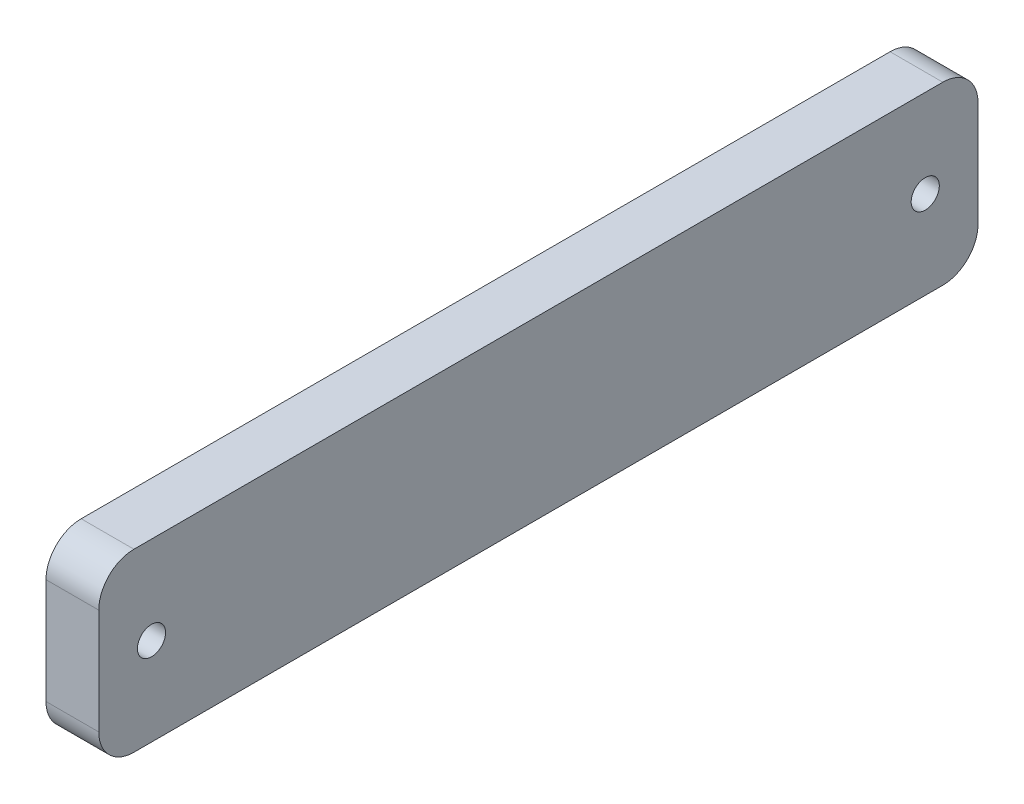
ISO-10303-21;
HEADER;
FILE_DESCRIPTION(('STEP AP214'),'2;1');
FILE_NAME('part.step','',(''),(''),'','','');
FILE_SCHEMA(('AUTOMOTIVE_DESIGN { 1 0 10303 214 1 1 1 1 }'));
ENDSEC;
DATA;
#1=APPLICATION_CONTEXT('core data for automotive mechanical design processes');
#2=APPLICATION_PROTOCOL_DEFINITION('international standard','automotive_design',2000,#1);
#3=PRODUCT_CONTEXT('',#1,'mechanical');
#4=PRODUCT('Part','Part','',(#3));
#5=PRODUCT_RELATED_PRODUCT_CATEGORY('part','',(#4));
#6=PRODUCT_DEFINITION_FORMATION('','',#4);
#7=PRODUCT_DEFINITION_CONTEXT('part definition',#1,'design');
#8=PRODUCT_DEFINITION('design','',#6,#7);
#9=PRODUCT_DEFINITION_SHAPE('','',#8);
#10=(LENGTH_UNIT() NAMED_UNIT(*) SI_UNIT(.MILLI.,.METRE.));
#11=(NAMED_UNIT(*) PLANE_ANGLE_UNIT() SI_UNIT($,.RADIAN.));
#12=(NAMED_UNIT(*) SI_UNIT($,.STERADIAN.) SOLID_ANGLE_UNIT());
#13=UNCERTAINTY_MEASURE_WITH_UNIT(LENGTH_MEASURE(1.E-05),#10,'distance_accuracy_value','');
#14=(GEOMETRIC_REPRESENTATION_CONTEXT(3) GLOBAL_UNCERTAINTY_ASSIGNED_CONTEXT((#13)) GLOBAL_UNIT_ASSIGNED_CONTEXT((#10,
#11,#12)) REPRESENTATION_CONTEXT('',''));
#15=CARTESIAN_POINT('',(0.,0.,0.));
#16=DIRECTION('',(0.,0.,1.));
#17=DIRECTION('',(1.,0.,0.));
#18=AXIS2_PLACEMENT_3D('',#15,#16,#17);
#19=CARTESIAN_POINT('',(3.,0.,0.));
#20=DIRECTION('',(1.,0.,0.));
#21=DIRECTION('',(0.,0.,-1.));
#22=AXIS2_PLACEMENT_3D('',#19,#20,#21);
#23=PLANE('',#22);
#24=CARTESIAN_POINT('',(3.,0.,22.));
#25=DIRECTION('',(1.,0.,0.));
#26=DIRECTION('',(0.,0.,-1.));
#27=AXIS2_PLACEMENT_3D('',#24,#25,#26);
#28=CIRCLE('',#27,0.799999999999999);
#29=CARTESIAN_POINT('',(3.,0.,21.2));
#30=VERTEX_POINT('',#29);
#31=EDGE_CURVE('E130',#30,#30,#28,.T.);
#32=ORIENTED_EDGE('',*,*,#31,.F.);
#33=EDGE_LOOP('',(#32));
#34=FACE_BOUND('',#33,.T.);
#35=DIRECTION('',(0.,0.,-1.));
#36=VECTOR('',#35,1.);
#37=CARTESIAN_POINT('',(3.,-5.,25.));
#38=LINE('',#37,#36);
#39=CARTESIAN_POINT('',(3.,-5.,23.));
#40=VERTEX_POINT('',#39);
#41=CARTESIAN_POINT('',(3.,-5.,-23.));
#42=VERTEX_POINT('',#41);
#43=EDGE_CURVE('E139',#40,#42,#38,.T.);
#44=ORIENTED_EDGE('',*,*,#43,.T.);
#45=CARTESIAN_POINT('',(3.,-3.,-23.));
#46=DIRECTION('',(1.,0.,0.));
#47=DIRECTION('',(0.,0.,-1.));
#48=AXIS2_PLACEMENT_3D('',#45,#46,#47);
#49=CIRCLE('',#48,2.);
#50=CARTESIAN_POINT('',(3.,-3.,-25.));
#51=VERTEX_POINT('',#50);
#52=EDGE_CURVE('E158',#42,#51,#49,.T.);
#53=ORIENTED_EDGE('',*,*,#52,.T.);
#54=DIRECTION('',(0.,1.,0.));
#55=VECTOR('',#54,1.);
#56=CARTESIAN_POINT('',(3.,5.,-25.));
#57=LINE('',#56,#55);
#58=CARTESIAN_POINT('',(3.,3.,-25.));
#59=VERTEX_POINT('',#58);
#60=EDGE_CURVE('E122',#51,#59,#57,.T.);
#61=ORIENTED_EDGE('',*,*,#60,.T.);
#62=CARTESIAN_POINT('',(3.,3.,-23.));
#63=DIRECTION('',(1.,0.,0.));
#64=DIRECTION('',(0.,0.,-1.));
#65=AXIS2_PLACEMENT_3D('',#62,#63,#64);
#66=CIRCLE('',#65,2.);
#67=CARTESIAN_POINT('',(3.,5.,-23.));
#68=VERTEX_POINT('',#67);
#69=EDGE_CURVE('E156',#59,#68,#66,.T.);
#70=ORIENTED_EDGE('',*,*,#69,.T.);
#71=DIRECTION('',(0.,0.,1.));
#72=VECTOR('',#71,1.);
#73=CARTESIAN_POINT('',(3.,5.,25.));
#74=LINE('',#73,#72);
#75=CARTESIAN_POINT('',(3.,5.,23.));
#76=VERTEX_POINT('',#75);
#77=EDGE_CURVE('E178',#68,#76,#74,.T.);
#78=ORIENTED_EDGE('',*,*,#77,.T.);
#79=CARTESIAN_POINT('',(3.,3.,23.));
#80=DIRECTION('',(1.,0.,0.));
#81=DIRECTION('',(0.,0.,-1.));
#82=AXIS2_PLACEMENT_3D('',#79,#80,#81);
#83=CIRCLE('',#82,2.);
#84=CARTESIAN_POINT('',(3.,3.,25.));
#85=VERTEX_POINT('',#84);
#86=EDGE_CURVE('E57',#76,#85,#83,.T.);
#87=ORIENTED_EDGE('',*,*,#86,.T.);
#88=DIRECTION('',(0.,-1.,0.));
#89=VECTOR('',#88,1.);
#90=CARTESIAN_POINT('',(3.,5.,25.));
#91=LINE('',#90,#89);
#92=CARTESIAN_POINT('',(3.,-3.,25.));
#93=VERTEX_POINT('',#92);
#94=EDGE_CURVE('E168',#85,#93,#91,.T.);
#95=ORIENTED_EDGE('',*,*,#94,.T.);
#96=CARTESIAN_POINT('',(3.,-3.,23.));
#97=DIRECTION('',(1.,0.,0.));
#98=DIRECTION('',(0.,0.,-1.));
#99=AXIS2_PLACEMENT_3D('',#96,#97,#98);
#100=CIRCLE('',#99,2.);
#101=EDGE_CURVE('E154',#93,#40,#100,.T.);
#102=ORIENTED_EDGE('',*,*,#101,.T.);
#103=EDGE_LOOP('',(#44,#53,#61,#70,#78,#87,#95,#102));
#104=FACE_BOUND('',#103,.T.);
#105=CARTESIAN_POINT('',(3.,0.,-22.));
#106=DIRECTION('',(1.,0.,0.));
#107=DIRECTION('',(0.,0.,1.));
#108=AXIS2_PLACEMENT_3D('',#105,#106,#107);
#109=CIRCLE('',#108,0.799999999999999);
#110=CARTESIAN_POINT('',(3.,0.,-21.2));
#111=VERTEX_POINT('',#110);
#112=EDGE_CURVE('E183',#111,#111,#109,.T.);
#113=ORIENTED_EDGE('',*,*,#112,.F.);
#114=EDGE_LOOP('',(#113));
#115=FACE_BOUND('',#114,.T.);
#116=ADVANCED_FACE('F37',(#34,#104,#115),#23,.T.);
#117=CARTESIAN_POINT('',(0.,0.,0.));
#118=DIRECTION('',(1.,0.,0.));
#119=DIRECTION('',(0.,0.,-1.));
#120=AXIS2_PLACEMENT_3D('',#117,#118,#119);
#121=PLANE('',#120);
#122=DIRECTION('',(0.,1.,0.));
#123=VECTOR('',#122,1.);
#124=CARTESIAN_POINT('',(0.,5.,-25.));
#125=LINE('',#124,#123);
#126=CARTESIAN_POINT('',(0.,-3.,-25.));
#127=VERTEX_POINT('',#126);
#128=CARTESIAN_POINT('',(0.,3.,-25.));
#129=VERTEX_POINT('',#128);
#130=EDGE_CURVE('E119',#127,#129,#125,.T.);
#131=ORIENTED_EDGE('',*,*,#130,.F.);
#132=CARTESIAN_POINT('',(0.,-3.,-23.));
#133=DIRECTION('',(1.,0.,0.));
#134=DIRECTION('',(0.,0.,-1.));
#135=AXIS2_PLACEMENT_3D('',#132,#133,#134);
#136=CIRCLE('',#135,2.);
#137=CARTESIAN_POINT('',(0.,-5.,-23.));
#138=VERTEX_POINT('',#137);
#139=EDGE_CURVE('E102',#127,#138,#136,.F.);
#140=ORIENTED_EDGE('',*,*,#139,.T.);
#141=DIRECTION('',(0.,0.,-1.));
#142=VECTOR('',#141,1.);
#143=CARTESIAN_POINT('',(0.,-5.,25.));
#144=LINE('',#143,#142);
#145=CARTESIAN_POINT('',(0.,-5.,23.));
#146=VERTEX_POINT('',#145);
#147=EDGE_CURVE('E143',#146,#138,#144,.T.);
#148=ORIENTED_EDGE('',*,*,#147,.F.);
#149=CARTESIAN_POINT('',(0.,-3.,23.));
#150=DIRECTION('',(1.,0.,0.));
#151=DIRECTION('',(0.,0.,-1.));
#152=AXIS2_PLACEMENT_3D('',#149,#150,#151);
#153=CIRCLE('',#152,2.);
#154=CARTESIAN_POINT('',(0.,-3.,25.));
#155=VERTEX_POINT('',#154);
#156=EDGE_CURVE('E147',#146,#155,#153,.F.);
#157=ORIENTED_EDGE('',*,*,#156,.T.);
#158=DIRECTION('',(0.,-1.,0.));
#159=VECTOR('',#158,1.);
#160=CARTESIAN_POINT('',(0.,5.,25.));
#161=LINE('',#160,#159);
#162=CARTESIAN_POINT('',(0.,3.,25.));
#163=VERTEX_POINT('',#162);
#164=EDGE_CURVE('E133',#163,#155,#161,.T.);
#165=ORIENTED_EDGE('',*,*,#164,.F.);
#166=CARTESIAN_POINT('',(0.,3.,23.));
#167=DIRECTION('',(1.,0.,0.));
#168=DIRECTION('',(0.,0.,-1.));
#169=AXIS2_PLACEMENT_3D('',#166,#167,#168);
#170=CIRCLE('',#169,2.);
#171=CARTESIAN_POINT('',(0.,5.,23.));
#172=VERTEX_POINT('',#171);
#173=EDGE_CURVE('E123',#163,#172,#170,.F.);
#174=ORIENTED_EDGE('',*,*,#173,.T.);
#175=DIRECTION('',(0.,0.,1.));
#176=VECTOR('',#175,1.);
#177=CARTESIAN_POINT('',(0.,5.,25.));
#178=LINE('',#177,#176);
#179=CARTESIAN_POINT('',(0.,5.,-23.));
#180=VERTEX_POINT('',#179);
#181=EDGE_CURVE('E129',#180,#172,#178,.T.);
#182=ORIENTED_EDGE('',*,*,#181,.F.);
#183=CARTESIAN_POINT('',(0.,3.,-23.));
#184=DIRECTION('',(1.,0.,0.));
#185=DIRECTION('',(0.,0.,-1.));
#186=AXIS2_PLACEMENT_3D('',#183,#184,#185);
#187=CIRCLE('',#186,2.);
#188=EDGE_CURVE('E113',#180,#129,#187,.F.);
#189=ORIENTED_EDGE('',*,*,#188,.T.);
#190=EDGE_LOOP('',(#131,#140,#148,#157,#165,#174,#182,#189));
#191=FACE_BOUND('',#190,.T.);
#192=CARTESIAN_POINT('',(0.,0.,22.));
#193=DIRECTION('',(1.,0.,0.));
#194=DIRECTION('',(0.,0.,-1.));
#195=AXIS2_PLACEMENT_3D('',#192,#193,#194);
#196=CIRCLE('',#195,0.799999999999999);
#197=CARTESIAN_POINT('',(0.,0.,21.2));
#198=VERTEX_POINT('',#197);
#199=EDGE_CURVE('E136',#198,#198,#196,.T.);
#200=ORIENTED_EDGE('',*,*,#199,.T.);
#201=EDGE_LOOP('',(#200));
#202=FACE_BOUND('',#201,.T.);
#203=CARTESIAN_POINT('',(0.,0.,-22.));
#204=DIRECTION('',(1.,0.,0.));
#205=DIRECTION('',(0.,0.,1.));
#206=AXIS2_PLACEMENT_3D('',#203,#204,#205);
#207=CIRCLE('',#206,0.799999999999999);
#208=CARTESIAN_POINT('',(0.,0.,-21.2));
#209=VERTEX_POINT('',#208);
#210=EDGE_CURVE('E185',#209,#209,#207,.T.);
#211=ORIENTED_EDGE('',*,*,#210,.T.);
#212=EDGE_LOOP('',(#211));
#213=FACE_BOUND('',#212,.T.);
#214=ADVANCED_FACE('F126',(#191,#202,#213),#121,.F.);
#215=CARTESIAN_POINT('',(3.,5.,-25.));
#216=DIRECTION('',(0.,0.,1.));
#217=DIRECTION('',(1.,0.,0.));
#218=AXIS2_PLACEMENT_3D('',#215,#216,#217);
#219=PLANE('',#218);
#220=ORIENTED_EDGE('',*,*,#60,.F.);
#221=DIRECTION('',(-1.,0.,0.));
#222=VECTOR('',#221,1.);
#223=CARTESIAN_POINT('',(3.,-3.,-25.));
#224=LINE('',#223,#222);
#225=EDGE_CURVE('E106',#51,#127,#224,.T.);
#226=ORIENTED_EDGE('',*,*,#225,.T.);
#227=ORIENTED_EDGE('',*,*,#130,.T.);
#228=DIRECTION('',(-1.,0.,0.));
#229=VECTOR('',#228,1.);
#230=CARTESIAN_POINT('',(3.,3.,-25.));
#231=LINE('',#230,#229);
#232=EDGE_CURVE('E124',#129,#59,#231,.F.);
#233=ORIENTED_EDGE('',*,*,#232,.T.);
#234=EDGE_LOOP('',(#220,#226,#227,#233));
#235=FACE_BOUND('',#234,.T.);
#236=ADVANCED_FACE('F118',(#235),#219,.F.);
#237=CARTESIAN_POINT('',(3.,5.,25.));
#238=DIRECTION('',(0.,-1.,0.));
#239=DIRECTION('',(0.,0.,-1.));
#240=AXIS2_PLACEMENT_3D('',#237,#238,#239);
#241=PLANE('',#240);
#242=ORIENTED_EDGE('',*,*,#77,.F.);
#243=DIRECTION('',(-1.,0.,0.));
#244=VECTOR('',#243,1.);
#245=CARTESIAN_POINT('',(3.,5.,-23.));
#246=LINE('',#245,#244);
#247=EDGE_CURVE('E162',#68,#180,#246,.T.);
#248=ORIENTED_EDGE('',*,*,#247,.T.);
#249=ORIENTED_EDGE('',*,*,#181,.T.);
#250=DIRECTION('',(-1.,0.,0.));
#251=VECTOR('',#250,1.);
#252=CARTESIAN_POINT('',(3.,5.,23.));
#253=LINE('',#252,#251);
#254=EDGE_CURVE('E160',#172,#76,#253,.F.);
#255=ORIENTED_EDGE('',*,*,#254,.T.);
#256=EDGE_LOOP('',(#242,#248,#249,#255));
#257=FACE_BOUND('',#256,.T.);
#258=ADVANCED_FACE('F210',(#257),#241,.F.);
#259=CARTESIAN_POINT('',(3.,5.,25.));
#260=DIRECTION('',(0.,0.,-1.));
#261=DIRECTION('',(-1.,0.,0.));
#262=AXIS2_PLACEMENT_3D('',#259,#260,#261);
#263=PLANE('',#262);
#264=ORIENTED_EDGE('',*,*,#164,.T.);
#265=DIRECTION('',(-1.,0.,0.));
#266=VECTOR('',#265,1.);
#267=CARTESIAN_POINT('',(3.,-3.,25.));
#268=LINE('',#267,#266);
#269=EDGE_CURVE('E11',#155,#93,#268,.F.);
#270=ORIENTED_EDGE('',*,*,#269,.T.);
#271=ORIENTED_EDGE('',*,*,#94,.F.);
#272=DIRECTION('',(-1.,0.,0.));
#273=VECTOR('',#272,1.);
#274=CARTESIAN_POINT('',(3.,3.,25.));
#275=LINE('',#274,#273);
#276=EDGE_CURVE('E45',#85,#163,#275,.T.);
#277=ORIENTED_EDGE('',*,*,#276,.T.);
#278=EDGE_LOOP('',(#264,#270,#271,#277));
#279=FACE_BOUND('',#278,.T.);
#280=ADVANCED_FACE('F167',(#279),#263,.F.);
#281=CARTESIAN_POINT('',(3.,-5.,25.));
#282=DIRECTION('',(0.,1.,0.));
#283=DIRECTION('',(0.,0.,1.));
#284=AXIS2_PLACEMENT_3D('',#281,#282,#283);
#285=PLANE('',#284);
#286=ORIENTED_EDGE('',*,*,#147,.T.);
#287=DIRECTION('',(-1.,0.,0.));
#288=VECTOR('',#287,1.);
#289=CARTESIAN_POINT('',(3.,-5.,-23.));
#290=LINE('',#289,#288);
#291=EDGE_CURVE('E107',#138,#42,#290,.F.);
#292=ORIENTED_EDGE('',*,*,#291,.T.);
#293=ORIENTED_EDGE('',*,*,#43,.F.);
#294=DIRECTION('',(-1.,0.,0.));
#295=VECTOR('',#294,1.);
#296=CARTESIAN_POINT('',(3.,-5.,23.));
#297=LINE('',#296,#295);
#298=EDGE_CURVE('E112',#40,#146,#297,.T.);
#299=ORIENTED_EDGE('',*,*,#298,.T.);
#300=EDGE_LOOP('',(#286,#292,#293,#299));
#301=FACE_BOUND('',#300,.T.);
#302=ADVANCED_FACE('F176',(#301),#285,.F.);
#303=CARTESIAN_POINT('',(3.,0.,22.));
#304=DIRECTION('',(-1.,0.,0.));
#305=DIRECTION('',(0.,0.,1.));
#306=AXIS2_PLACEMENT_3D('',#303,#304,#305);
#307=CYLINDRICAL_SURFACE('',#306,0.799999999999999);
#308=ORIENTED_EDGE('',*,*,#31,.T.);
#309=EDGE_LOOP('',(#308));
#310=FACE_BOUND('',#309,.T.);
#311=ORIENTED_EDGE('',*,*,#199,.F.);
#312=EDGE_LOOP('',(#311));
#313=FACE_BOUND('',#312,.T.);
#314=ADVANCED_FACE('F203',(#310,#313),#307,.F.);
#315=CARTESIAN_POINT('',(3.,0.,-22.));
#316=DIRECTION('',(-1.,0.,0.));
#317=DIRECTION('',(0.,0.,1.));
#318=AXIS2_PLACEMENT_3D('',#315,#316,#317);
#319=CYLINDRICAL_SURFACE('',#318,0.799999999999999);
#320=ORIENTED_EDGE('',*,*,#112,.T.);
#321=EDGE_LOOP('',(#320));
#322=FACE_BOUND('',#321,.T.);
#323=ORIENTED_EDGE('',*,*,#210,.F.);
#324=EDGE_LOOP('',(#323));
#325=FACE_BOUND('',#324,.T.);
#326=ADVANCED_FACE('F191',(#322,#325),#319,.F.);
#327=CARTESIAN_POINT('',(3.,-3.,-23.));
#328=DIRECTION('',(-1.,0.,0.));
#329=DIRECTION('',(0.,0.,1.));
#330=AXIS2_PLACEMENT_3D('',#327,#328,#329);
#331=CYLINDRICAL_SURFACE('',#330,2.);
#332=ORIENTED_EDGE('',*,*,#52,.F.);
#333=ORIENTED_EDGE('',*,*,#291,.F.);
#334=ORIENTED_EDGE('',*,*,#139,.F.);
#335=ORIENTED_EDGE('',*,*,#225,.F.);
#336=EDGE_LOOP('',(#332,#333,#334,#335));
#337=FACE_BOUND('',#336,.T.);
#338=ADVANCED_FACE('F105',(#337),#331,.T.);
#339=CARTESIAN_POINT('',(3.,3.,-23.));
#340=DIRECTION('',(-1.,0.,0.));
#341=DIRECTION('',(0.,0.,1.));
#342=AXIS2_PLACEMENT_3D('',#339,#340,#341);
#343=CYLINDRICAL_SURFACE('',#342,2.);
#344=ORIENTED_EDGE('',*,*,#69,.F.);
#345=ORIENTED_EDGE('',*,*,#232,.F.);
#346=ORIENTED_EDGE('',*,*,#188,.F.);
#347=ORIENTED_EDGE('',*,*,#247,.F.);
#348=EDGE_LOOP('',(#344,#345,#346,#347));
#349=FACE_BOUND('',#348,.T.);
#350=ADVANCED_FACE('F218',(#349),#343,.T.);
#351=CARTESIAN_POINT('',(3.,-3.,23.));
#352=DIRECTION('',(-1.,0.,0.));
#353=DIRECTION('',(0.,0.,1.));
#354=AXIS2_PLACEMENT_3D('',#351,#352,#353);
#355=CYLINDRICAL_SURFACE('',#354,2.);
#356=ORIENTED_EDGE('',*,*,#101,.F.);
#357=ORIENTED_EDGE('',*,*,#269,.F.);
#358=ORIENTED_EDGE('',*,*,#156,.F.);
#359=ORIENTED_EDGE('',*,*,#298,.F.);
#360=EDGE_LOOP('',(#356,#357,#358,#359));
#361=FACE_BOUND('',#360,.T.);
#362=ADVANCED_FACE('F173',(#361),#355,.T.);
#363=CARTESIAN_POINT('',(3.,3.,23.));
#364=DIRECTION('',(-1.,0.,0.));
#365=DIRECTION('',(0.,0.,1.));
#366=AXIS2_PLACEMENT_3D('',#363,#364,#365);
#367=CYLINDRICAL_SURFACE('',#366,2.);
#368=ORIENTED_EDGE('',*,*,#86,.F.);
#369=ORIENTED_EDGE('',*,*,#254,.F.);
#370=ORIENTED_EDGE('',*,*,#173,.F.);
#371=ORIENTED_EDGE('',*,*,#276,.F.);
#372=EDGE_LOOP('',(#368,#369,#370,#371));
#373=FACE_BOUND('',#372,.T.);
#374=ADVANCED_FACE('F39',(#373),#367,.T.);
#375=CLOSED_SHELL('',(#116,#214,#236,#258,#280,#302,#314,#326,#338,#350,#362,#374));
#376=MANIFOLD_SOLID_BREP('B2',#375);
#377=ADVANCED_BREP_SHAPE_REPRESENTATION('',(#18,#376),#14);
#378=SHAPE_DEFINITION_REPRESENTATION(#9,#377);
ENDSEC;
END-ISO-10303-21;
